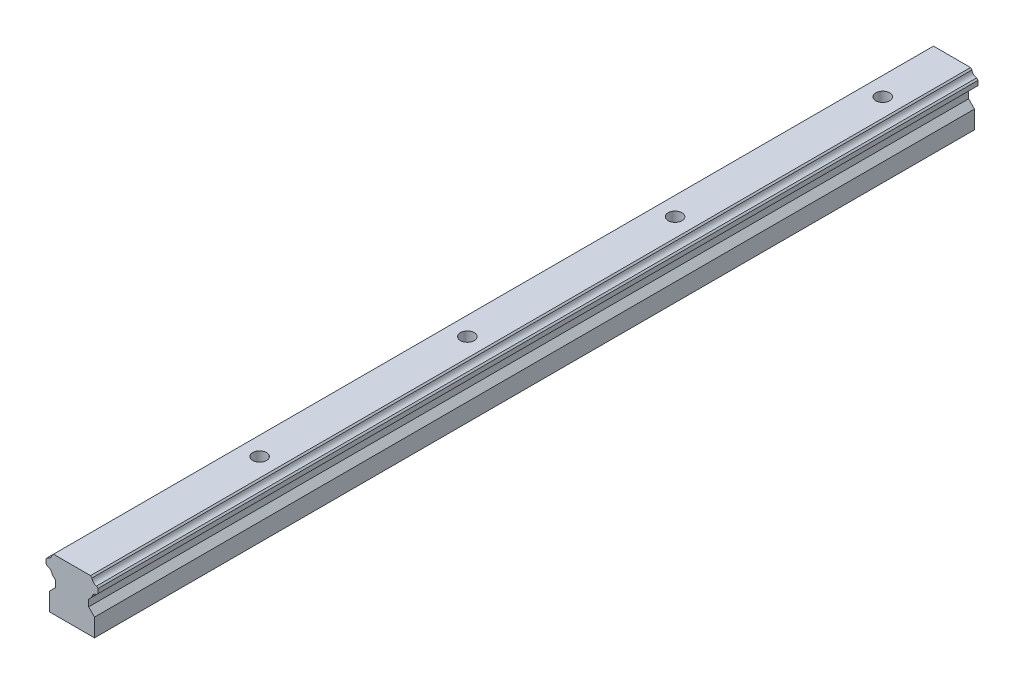
ISO-10303-21;
HEADER;
FILE_DESCRIPTION(('STEP AP214'),'2;1');
FILE_NAME('part.step','',(''),(''),'','','');
FILE_SCHEMA(('AUTOMOTIVE_DESIGN { 1 0 10303 214 1 1 1 1 }'));
ENDSEC;
DATA;
#1=APPLICATION_CONTEXT('core data for automotive mechanical design processes');
#2=APPLICATION_PROTOCOL_DEFINITION('international standard','automotive_design',2000,#1);
#3=PRODUCT_CONTEXT('',#1,'mechanical');
#4=PRODUCT('Part','Part','',(#3));
#5=PRODUCT_RELATED_PRODUCT_CATEGORY('part','',(#4));
#6=PRODUCT_DEFINITION_FORMATION('','',#4);
#7=PRODUCT_DEFINITION_CONTEXT('part definition',#1,'design');
#8=PRODUCT_DEFINITION('design','',#6,#7);
#9=PRODUCT_DEFINITION_SHAPE('','',#8);
#10=(LENGTH_UNIT() NAMED_UNIT(*) SI_UNIT(.MILLI.,.METRE.));
#11=(NAMED_UNIT(*) PLANE_ANGLE_UNIT() SI_UNIT($,.RADIAN.));
#12=(NAMED_UNIT(*) SI_UNIT($,.STERADIAN.) SOLID_ANGLE_UNIT());
#13=UNCERTAINTY_MEASURE_WITH_UNIT(LENGTH_MEASURE(1.E-05),#10,'distance_accuracy_value','');
#14=(GEOMETRIC_REPRESENTATION_CONTEXT(3) GLOBAL_UNCERTAINTY_ASSIGNED_CONTEXT((#13)) GLOBAL_UNIT_ASSIGNED_CONTEXT((#10,
#11,#12)) REPRESENTATION_CONTEXT('',''));
#15=CARTESIAN_POINT('',(0.,0.,0.));
#16=DIRECTION('',(0.,0.,1.));
#17=DIRECTION('',(1.,0.,0.));
#18=AXIS2_PLACEMENT_3D('',#15,#16,#17);
#19=CARTESIAN_POINT('',(-6.5,5.20000000000005,254.));
#20=DIRECTION('',(0.707106781186548,-0.707106781186548,0.));
#21=DIRECTION('',(0.707106781186548,0.707106781186548,0.));
#22=AXIS2_PLACEMENT_3D('',#19,#20,#21);
#23=PLANE('',#22);
#24=DIRECTION('',(-0.707106781186547,-0.707106781186547,0.));
#25=VECTOR('',#24,1.);
#26=CARTESIAN_POINT('',(-6.5,5.20000000000005,0.));
#27=LINE('',#26,#25);
#28=CARTESIAN_POINT('',(-4.8,6.90000000000005,0.));
#29=VERTEX_POINT('',#28);
#30=CARTESIAN_POINT('',(-6.5,5.20000000000005,0.));
#31=VERTEX_POINT('',#30);
#32=EDGE_CURVE('E214',#29,#31,#27,.T.);
#33=ORIENTED_EDGE('',*,*,#32,.T.);
#34=DIRECTION('',(0.,0.,-1.));
#35=VECTOR('',#34,1.);
#36=CARTESIAN_POINT('',(-6.5,5.20000000000005,254.));
#37=LINE('',#36,#35);
#38=CARTESIAN_POINT('',(-6.5,5.20000000000005,254.));
#39=VERTEX_POINT('',#38);
#40=EDGE_CURVE('E11',#39,#31,#37,.T.);
#41=ORIENTED_EDGE('',*,*,#40,.F.);
#42=DIRECTION('',(-0.707106781186547,-0.707106781186547,0.));
#43=VECTOR('',#42,1.);
#44=CARTESIAN_POINT('',(-6.5,5.20000000000005,254.));
#45=LINE('',#44,#43);
#46=CARTESIAN_POINT('',(-4.8,6.90000000000005,254.));
#47=VERTEX_POINT('',#46);
#48=EDGE_CURVE('E257',#47,#39,#45,.T.);
#49=ORIENTED_EDGE('',*,*,#48,.F.);
#50=DIRECTION('',(0.,0.,-1.));
#51=VECTOR('',#50,1.);
#52=CARTESIAN_POINT('',(-4.8,6.90000000000005,254.));
#53=LINE('',#52,#51);
#54=EDGE_CURVE('E210',#47,#29,#53,.T.);
#55=ORIENTED_EDGE('',*,*,#54,.T.);
#56=EDGE_LOOP('',(#33,#41,#49,#55));
#57=FACE_BOUND('',#56,.T.);
#58=ADVANCED_FACE('F34',(#57),#23,.F.);
#59=CARTESIAN_POINT('',(-6.5,5.20000000000005,254.));
#60=DIRECTION('',(1.,0.,0.));
#61=DIRECTION('',(0.,0.,-1.));
#62=AXIS2_PLACEMENT_3D('',#59,#60,#61);
#63=PLANE('',#62);
#64=DIRECTION('',(0.,-1.,0.));
#65=VECTOR('',#64,1.);
#66=CARTESIAN_POINT('',(-6.5,5.20000000000005,0.));
#67=LINE('',#66,#65);
#68=CARTESIAN_POINT('',(-6.5,0.,0.));
#69=VERTEX_POINT('',#68);
#70=EDGE_CURVE('E217',#31,#69,#67,.T.);
#71=ORIENTED_EDGE('',*,*,#70,.T.);
#72=DIRECTION('',(0.,0.,-1.));
#73=VECTOR('',#72,1.);
#74=CARTESIAN_POINT('',(-6.5,0.,254.));
#75=LINE('',#74,#73);
#76=CARTESIAN_POINT('',(-6.5,0.,254.));
#77=VERTEX_POINT('',#76);
#78=EDGE_CURVE('E42',#77,#69,#75,.T.);
#79=ORIENTED_EDGE('',*,*,#78,.F.);
#80=DIRECTION('',(0.,-1.,0.));
#81=VECTOR('',#80,1.);
#82=CARTESIAN_POINT('',(-6.5,5.20000000000005,254.));
#83=LINE('',#82,#81);
#84=EDGE_CURVE('E135',#39,#77,#83,.T.);
#85=ORIENTED_EDGE('',*,*,#84,.F.);
#86=ORIENTED_EDGE('',*,*,#40,.T.);
#87=EDGE_LOOP('',(#71,#79,#85,#86));
#88=FACE_BOUND('',#87,.T.);
#89=ADVANCED_FACE('F385',(#88),#63,.F.);
#90=CARTESIAN_POINT('',(-6.5,0.,254.));
#91=DIRECTION('',(0.,1.,0.));
#92=DIRECTION('',(0.,0.,1.));
#93=AXIS2_PLACEMENT_3D('',#90,#91,#92);
#94=PLANE('',#93);
#95=CARTESIAN_POINT('',(0.,0.,20.));
#96=DIRECTION('',(0.,1.,0.));
#97=DIRECTION('',(0.,0.,1.));
#98=AXIS2_PLACEMENT_3D('',#95,#96,#97);
#99=CIRCLE('',#98,2.);
#100=CARTESIAN_POINT('',(0.,0.,22.));
#101=VERTEX_POINT('',#100);
#102=EDGE_CURVE('E218',#101,#101,#99,.T.);
#103=ORIENTED_EDGE('',*,*,#102,.T.);
#104=EDGE_LOOP('',(#103));
#105=FACE_BOUND('',#104,.T.);
#106=CARTESIAN_POINT('',(0.,0.,79.944));
#107=DIRECTION('',(0.,1.,0.));
#108=DIRECTION('',(0.,0.,1.));
#109=AXIS2_PLACEMENT_3D('',#106,#107,#108);
#110=CIRCLE('',#109,2.);
#111=CARTESIAN_POINT('',(0.,0.,81.944));
#112=VERTEX_POINT('',#111);
#113=EDGE_CURVE('E543',#112,#112,#110,.T.);
#114=ORIENTED_EDGE('',*,*,#113,.T.);
#115=EDGE_LOOP('',(#114));
#116=FACE_BOUND('',#115,.T.);
#117=CARTESIAN_POINT('',(0.,0.,139.888));
#118=DIRECTION('',(0.,1.,0.));
#119=DIRECTION('',(0.,0.,1.));
#120=AXIS2_PLACEMENT_3D('',#117,#118,#119);
#121=CIRCLE('',#120,2.);
#122=CARTESIAN_POINT('',(0.,0.,141.888));
#123=VERTEX_POINT('',#122);
#124=EDGE_CURVE('E552',#123,#123,#121,.T.);
#125=ORIENTED_EDGE('',*,*,#124,.T.);
#126=EDGE_LOOP('',(#125));
#127=FACE_BOUND('',#126,.T.);
#128=CARTESIAN_POINT('',(0.,0.,199.832));
#129=DIRECTION('',(0.,1.,0.));
#130=DIRECTION('',(0.,0.,1.));
#131=AXIS2_PLACEMENT_3D('',#128,#129,#130);
#132=CIRCLE('',#131,2.);
#133=CARTESIAN_POINT('',(0.,0.,201.832));
#134=VERTEX_POINT('',#133);
#135=EDGE_CURVE('E558',#134,#134,#132,.T.);
#136=ORIENTED_EDGE('',*,*,#135,.T.);
#137=EDGE_LOOP('',(#136));
#138=FACE_BOUND('',#137,.T.);
#139=DIRECTION('',(1.,0.,0.));
#140=VECTOR('',#139,1.);
#141=CARTESIAN_POINT('',(-6.5,0.,0.));
#142=LINE('',#141,#140);
#143=CARTESIAN_POINT('',(6.5,0.,0.));
#144=VERTEX_POINT('',#143);
#145=EDGE_CURVE('E220',#69,#144,#142,.T.);
#146=ORIENTED_EDGE('',*,*,#145,.T.);
#147=DIRECTION('',(0.,0.,-1.));
#148=VECTOR('',#147,1.);
#149=CARTESIAN_POINT('',(6.5,0.,254.));
#150=LINE('',#149,#148);
#151=CARTESIAN_POINT('',(6.5,0.,254.));
#152=VERTEX_POINT('',#151);
#153=EDGE_CURVE('E306',#152,#144,#150,.T.);
#154=ORIENTED_EDGE('',*,*,#153,.F.);
#155=DIRECTION('',(1.,0.,0.));
#156=VECTOR('',#155,1.);
#157=CARTESIAN_POINT('',(-6.5,0.,254.));
#158=LINE('',#157,#156);
#159=EDGE_CURVE('E314',#77,#152,#158,.T.);
#160=ORIENTED_EDGE('',*,*,#159,.F.);
#161=ORIENTED_EDGE('',*,*,#78,.T.);
#162=EDGE_LOOP('',(#146,#154,#160,#161));
#163=FACE_BOUND('',#162,.T.);
#164=ADVANCED_FACE('F312',(#105,#116,#127,#138,#163),#94,.F.);
#165=CARTESIAN_POINT('',(6.5,5.20000000000005,254.));
#166=DIRECTION('',(-1.,0.,0.));
#167=DIRECTION('',(0.,0.,1.));
#168=AXIS2_PLACEMENT_3D('',#165,#166,#167);
#169=PLANE('',#168);
#170=DIRECTION('',(0.,1.,0.));
#171=VECTOR('',#170,1.);
#172=CARTESIAN_POINT('',(6.5,5.20000000000005,0.));
#173=LINE('',#172,#171);
#174=CARTESIAN_POINT('',(6.5,5.20000000000005,0.));
#175=VERTEX_POINT('',#174);
#176=EDGE_CURVE('E222',#144,#175,#173,.T.);
#177=ORIENTED_EDGE('',*,*,#176,.T.);
#178=DIRECTION('',(0.,0.,-1.));
#179=VECTOR('',#178,1.);
#180=CARTESIAN_POINT('',(6.5,5.20000000000005,254.));
#181=LINE('',#180,#179);
#182=CARTESIAN_POINT('',(6.5,5.20000000000005,254.));
#183=VERTEX_POINT('',#182);
#184=EDGE_CURVE('E303',#183,#175,#181,.T.);
#185=ORIENTED_EDGE('',*,*,#184,.F.);
#186=DIRECTION('',(0.,1.,0.));
#187=VECTOR('',#186,1.);
#188=CARTESIAN_POINT('',(6.5,5.20000000000005,254.));
#189=LINE('',#188,#187);
#190=EDGE_CURVE('E332',#152,#183,#189,.T.);
#191=ORIENTED_EDGE('',*,*,#190,.F.);
#192=ORIENTED_EDGE('',*,*,#153,.T.);
#193=EDGE_LOOP('',(#177,#185,#191,#192));
#194=FACE_BOUND('',#193,.T.);
#195=ADVANCED_FACE('F323',(#194),#169,.F.);
#196=CARTESIAN_POINT('',(4.8,6.90000000000005,254.));
#197=DIRECTION('',(-0.707106781186548,-0.707106781186548,0.));
#198=DIRECTION('',(0.707106781186548,-0.707106781186548,0.));
#199=AXIS2_PLACEMENT_3D('',#196,#197,#198);
#200=PLANE('',#199);
#201=DIRECTION('',(-0.707106781186547,0.707106781186547,0.));
#202=VECTOR('',#201,1.);
#203=CARTESIAN_POINT('',(4.8,6.90000000000005,0.));
#204=LINE('',#203,#202);
#205=CARTESIAN_POINT('',(4.8,6.90000000000005,0.));
#206=VERTEX_POINT('',#205);
#207=EDGE_CURVE('E224',#175,#206,#204,.T.);
#208=ORIENTED_EDGE('',*,*,#207,.T.);
#209=DIRECTION('',(0.,0.,-1.));
#210=VECTOR('',#209,1.);
#211=CARTESIAN_POINT('',(4.8,6.90000000000005,254.));
#212=LINE('',#211,#210);
#213=CARTESIAN_POINT('',(4.8,6.90000000000005,254.));
#214=VERTEX_POINT('',#213);
#215=EDGE_CURVE('E300',#214,#206,#212,.T.);
#216=ORIENTED_EDGE('',*,*,#215,.F.);
#217=DIRECTION('',(-0.707106781186547,0.707106781186547,0.));
#218=VECTOR('',#217,1.);
#219=CARTESIAN_POINT('',(4.8,6.90000000000005,254.));
#220=LINE('',#219,#218);
#221=EDGE_CURVE('E329',#183,#214,#220,.T.);
#222=ORIENTED_EDGE('',*,*,#221,.F.);
#223=ORIENTED_EDGE('',*,*,#184,.T.);
#224=EDGE_LOOP('',(#208,#216,#222,#223));
#225=FACE_BOUND('',#224,.T.);
#226=ADVANCED_FACE('F327',(#225),#200,.F.);
#227=CARTESIAN_POINT('',(4.8,8.84000000000005,254.));
#228=DIRECTION('',(-1.,0.,0.));
#229=DIRECTION('',(0.,0.,1.));
#230=AXIS2_PLACEMENT_3D('',#227,#228,#229);
#231=PLANE('',#230);
#232=DIRECTION('',(0.,1.,0.));
#233=VECTOR('',#232,1.);
#234=CARTESIAN_POINT('',(4.8,8.84000000000005,0.));
#235=LINE('',#234,#233);
#236=CARTESIAN_POINT('',(4.8,8.84000000000005,0.));
#237=VERTEX_POINT('',#236);
#238=EDGE_CURVE('E226',#206,#237,#235,.T.);
#239=ORIENTED_EDGE('',*,*,#238,.T.);
#240=DIRECTION('',(0.,0.,-1.));
#241=VECTOR('',#240,1.);
#242=CARTESIAN_POINT('',(4.8,8.84000000000005,254.));
#243=LINE('',#242,#241);
#244=CARTESIAN_POINT('',(4.8,8.84000000000005,254.));
#245=VERTEX_POINT('',#244);
#246=EDGE_CURVE('E297',#245,#237,#243,.T.);
#247=ORIENTED_EDGE('',*,*,#246,.F.);
#248=DIRECTION('',(0.,1.,0.));
#249=VECTOR('',#248,1.);
#250=CARTESIAN_POINT('',(4.8,8.84000000000005,254.));
#251=LINE('',#250,#249);
#252=EDGE_CURVE('E331',#214,#245,#251,.T.);
#253=ORIENTED_EDGE('',*,*,#252,.F.);
#254=ORIENTED_EDGE('',*,*,#215,.T.);
#255=EDGE_LOOP('',(#239,#247,#253,#254));
#256=FACE_BOUND('',#255,.T.);
#257=ADVANCED_FACE('F399',(#256),#231,.F.);
#258=CARTESIAN_POINT('',(5.7548684340674,9.79486843406745,254.));
#259=DIRECTION('',(-0.707106781186548,0.707106781186547,0.));
#260=DIRECTION('',(-0.707106781186547,-0.707106781186548,0.));
#261=AXIS2_PLACEMENT_3D('',#258,#259,#260);
#262=PLANE('',#261);
#263=DIRECTION('',(0.707106781186547,0.707106781186548,0.));
#264=VECTOR('',#263,1.);
#265=CARTESIAN_POINT('',(5.7548684340674,9.79486843406745,0.));
#266=LINE('',#265,#264);
#267=CARTESIAN_POINT('',(5.7548684340674,9.79486843406745,0.));
#268=VERTEX_POINT('',#267);
#269=EDGE_CURVE('E228',#237,#268,#266,.T.);
#270=ORIENTED_EDGE('',*,*,#269,.T.);
#271=DIRECTION('',(0.,0.,-1.));
#272=VECTOR('',#271,1.);
#273=CARTESIAN_POINT('',(5.7548684340674,9.79486843406745,254.));
#274=LINE('',#273,#272);
#275=CARTESIAN_POINT('',(5.7548684340674,9.79486843406745,254.));
#276=VERTEX_POINT('',#275);
#277=EDGE_CURVE('E294',#276,#268,#274,.T.);
#278=ORIENTED_EDGE('',*,*,#277,.F.);
#279=DIRECTION('',(0.707106781186547,0.707106781186548,0.));
#280=VECTOR('',#279,1.);
#281=CARTESIAN_POINT('',(5.7548684340674,9.79486843406745,254.));
#282=LINE('',#281,#280);
#283=EDGE_CURVE('E334',#245,#276,#282,.T.);
#284=ORIENTED_EDGE('',*,*,#283,.F.);
#285=ORIENTED_EDGE('',*,*,#246,.T.);
#286=EDGE_LOOP('',(#270,#278,#284,#285));
#287=FACE_BOUND('',#286,.T.);
#288=ADVANCED_FACE('F402',(#287),#262,.F.);
#289=CARTESIAN_POINT('',(7.29999999999997,9.58000000000008,254.));
#290=DIRECTION('',(0.,0.,-1.));
#291=DIRECTION('',(-1.,0.,0.));
#292=AXIS2_PLACEMENT_3D('',#289,#290,#291);
#293=CYLINDRICAL_SURFACE('',#292,1.55999999999993);
#294=CARTESIAN_POINT('',(7.29999999999997,9.58000000000008,0.));
#295=DIRECTION('',(0.,0.,-1.));
#296=DIRECTION('',(1.,0.,0.));
#297=AXIS2_PLACEMENT_3D('',#294,#295,#296);
#298=CIRCLE('',#297,1.55999999999993);
#299=CARTESIAN_POINT('',(7.0851315659326,11.1251315659326,0.));
#300=VERTEX_POINT('',#299);
#301=EDGE_CURVE('E230',#268,#300,#298,.T.);
#302=ORIENTED_EDGE('',*,*,#301,.T.);
#303=DIRECTION('',(0.,0.,-1.));
#304=VECTOR('',#303,1.);
#305=CARTESIAN_POINT('',(7.0851315659326,11.1251315659326,254.));
#306=LINE('',#305,#304);
#307=CARTESIAN_POINT('',(7.0851315659326,11.1251315659326,254.));
#308=VERTEX_POINT('',#307);
#309=EDGE_CURVE('E291',#308,#300,#306,.T.);
#310=ORIENTED_EDGE('',*,*,#309,.F.);
#311=CARTESIAN_POINT('',(7.29999999999997,9.58000000000008,254.));
#312=DIRECTION('',(0.,0.,-1.));
#313=DIRECTION('',(1.,0.,0.));
#314=AXIS2_PLACEMENT_3D('',#311,#312,#313);
#315=CIRCLE('',#314,1.55999999999993);
#316=EDGE_CURVE('E340',#276,#308,#315,.T.);
#317=ORIENTED_EDGE('',*,*,#316,.F.);
#318=ORIENTED_EDGE('',*,*,#277,.T.);
#319=EDGE_LOOP('',(#302,#310,#317,#318));
#320=FACE_BOUND('',#319,.T.);
#321=ADVANCED_FACE('F406',(#320),#293,.F.);
#322=CARTESIAN_POINT('',(7.5,11.54,254.));
#323=DIRECTION('',(-0.707106781186548,0.707106781186547,0.));
#324=DIRECTION('',(-0.707106781186547,-0.707106781186548,0.));
#325=AXIS2_PLACEMENT_3D('',#322,#323,#324);
#326=PLANE('',#325);
#327=DIRECTION('',(0.707106781186547,0.707106781186548,0.));
#328=VECTOR('',#327,1.);
#329=CARTESIAN_POINT('',(7.5,11.54,0.));
#330=LINE('',#329,#328);
#331=CARTESIAN_POINT('',(7.5,11.54,0.));
#332=VERTEX_POINT('',#331);
#333=EDGE_CURVE('E232',#300,#332,#330,.T.);
#334=ORIENTED_EDGE('',*,*,#333,.T.);
#335=DIRECTION('',(0.,0.,-1.));
#336=VECTOR('',#335,1.);
#337=CARTESIAN_POINT('',(7.5,11.54,254.));
#338=LINE('',#337,#336);
#339=CARTESIAN_POINT('',(7.5,11.54,254.));
#340=VERTEX_POINT('',#339);
#341=EDGE_CURVE('E288',#340,#332,#338,.T.);
#342=ORIENTED_EDGE('',*,*,#341,.F.);
#343=DIRECTION('',(0.707106781186547,0.707106781186548,0.));
#344=VECTOR('',#343,1.);
#345=CARTESIAN_POINT('',(7.5,11.54,254.));
#346=LINE('',#345,#344);
#347=EDGE_CURVE('E342',#308,#340,#346,.T.);
#348=ORIENTED_EDGE('',*,*,#347,.F.);
#349=ORIENTED_EDGE('',*,*,#309,.T.);
#350=EDGE_LOOP('',(#334,#342,#348,#349));
#351=FACE_BOUND('',#350,.T.);
#352=ADVANCED_FACE('F410',(#351),#326,.F.);
#353=CARTESIAN_POINT('',(7.5,12.85,254.));
#354=DIRECTION('',(-1.,0.,0.));
#355=DIRECTION('',(0.,0.,1.));
#356=AXIS2_PLACEMENT_3D('',#353,#354,#355);
#357=PLANE('',#356);
#358=DIRECTION('',(0.,1.,0.));
#359=VECTOR('',#358,1.);
#360=CARTESIAN_POINT('',(7.5,12.85,0.));
#361=LINE('',#360,#359);
#362=CARTESIAN_POINT('',(7.5,12.85,0.));
#363=VERTEX_POINT('',#362);
#364=EDGE_CURVE('E234',#332,#363,#361,.T.);
#365=ORIENTED_EDGE('',*,*,#364,.T.);
#366=DIRECTION('',(0.,0.,-1.));
#367=VECTOR('',#366,1.);
#368=CARTESIAN_POINT('',(7.5,12.85,254.));
#369=LINE('',#368,#367);
#370=CARTESIAN_POINT('',(7.5,12.85,254.));
#371=VERTEX_POINT('',#370);
#372=EDGE_CURVE('E285',#371,#363,#369,.T.);
#373=ORIENTED_EDGE('',*,*,#372,.F.);
#374=DIRECTION('',(0.,1.,0.));
#375=VECTOR('',#374,1.);
#376=CARTESIAN_POINT('',(7.5,12.85,254.));
#377=LINE('',#376,#375);
#378=EDGE_CURVE('E344',#340,#371,#377,.T.);
#379=ORIENTED_EDGE('',*,*,#378,.F.);
#380=ORIENTED_EDGE('',*,*,#341,.T.);
#381=EDGE_LOOP('',(#365,#373,#379,#380));
#382=FACE_BOUND('',#381,.T.);
#383=ADVANCED_FACE('F414',(#382),#357,.F.);
#384=CARTESIAN_POINT('',(7.0816423301223,13.2683576698777,254.));
#385=DIRECTION('',(-0.707106781186549,-0.707106781186546,0.));
#386=DIRECTION('',(0.707106781186546,-0.707106781186549,0.));
#387=AXIS2_PLACEMENT_3D('',#384,#385,#386);
#388=PLANE('',#387);
#389=DIRECTION('',(-0.707106781186546,0.707106781186549,0.));
#390=VECTOR('',#389,1.);
#391=CARTESIAN_POINT('',(7.0816423301223,13.2683576698777,0.));
#392=LINE('',#391,#390);
#393=CARTESIAN_POINT('',(7.0816423301223,13.2683576698777,0.));
#394=VERTEX_POINT('',#393);
#395=EDGE_CURVE('E236',#363,#394,#392,.T.);
#396=ORIENTED_EDGE('',*,*,#395,.T.);
#397=DIRECTION('',(0.,0.,-1.));
#398=VECTOR('',#397,1.);
#399=CARTESIAN_POINT('',(7.0816423301223,13.2683576698777,254.));
#400=LINE('',#399,#398);
#401=CARTESIAN_POINT('',(7.0816423301223,13.2683576698777,254.));
#402=VERTEX_POINT('',#401);
#403=EDGE_CURVE('E282',#402,#394,#400,.T.);
#404=ORIENTED_EDGE('',*,*,#403,.F.);
#405=DIRECTION('',(-0.707106781186546,0.707106781186549,0.));
#406=VECTOR('',#405,1.);
#407=CARTESIAN_POINT('',(7.0816423301223,13.2683576698777,254.));
#408=LINE('',#407,#406);
#409=EDGE_CURVE('E346',#371,#402,#408,.T.);
#410=ORIENTED_EDGE('',*,*,#409,.F.);
#411=ORIENTED_EDGE('',*,*,#372,.T.);
#412=EDGE_LOOP('',(#396,#404,#410,#411));
#413=FACE_BOUND('',#412,.T.);
#414=ADVANCED_FACE('F418',(#413),#388,.F.);
#415=CARTESIAN_POINT('',(7.30000000000014,14.8130000000002,254.));
#416=DIRECTION('',(0.,0.,-1.));
#417=DIRECTION('',(-1.,0.,0.));
#418=AXIS2_PLACEMENT_3D('',#415,#416,#417);
#419=CYLINDRICAL_SURFACE('',#418,1.56000000000018);
#420=CARTESIAN_POINT('',(7.30000000000014,14.8130000000002,0.));
#421=DIRECTION('',(0.,0.,-1.));
#422=DIRECTION('',(1.,0.,0.));
#423=AXIS2_PLACEMENT_3D('',#420,#421,#422);
#424=CIRCLE('',#423,1.56000000000018);
#425=CARTESIAN_POINT('',(5.7553576698777,14.5946423301223,0.));
#426=VERTEX_POINT('',#425);
#427=EDGE_CURVE('E238',#394,#426,#424,.T.);
#428=ORIENTED_EDGE('',*,*,#427,.T.);
#429=DIRECTION('',(0.,0.,-1.));
#430=VECTOR('',#429,1.);
#431=CARTESIAN_POINT('',(5.7553576698777,14.5946423301223,254.));
#432=LINE('',#431,#430);
#433=CARTESIAN_POINT('',(5.7553576698777,14.5946423301223,254.));
#434=VERTEX_POINT('',#433);
#435=EDGE_CURVE('E279',#434,#426,#432,.T.);
#436=ORIENTED_EDGE('',*,*,#435,.F.);
#437=CARTESIAN_POINT('',(7.30000000000014,14.8130000000002,254.));
#438=DIRECTION('',(0.,0.,-1.));
#439=DIRECTION('',(1.,0.,0.));
#440=AXIS2_PLACEMENT_3D('',#437,#438,#439);
#441=CIRCLE('',#440,1.56000000000018);
#442=EDGE_CURVE('E348',#402,#434,#441,.T.);
#443=ORIENTED_EDGE('',*,*,#442,.F.);
#444=ORIENTED_EDGE('',*,*,#403,.T.);
#445=EDGE_LOOP('',(#428,#436,#443,#444));
#446=FACE_BOUND('',#445,.T.);
#447=ADVANCED_FACE('F422',(#446),#419,.F.);
#448=CARTESIAN_POINT('',(5.35,15.,254.));
#449=DIRECTION('',(-0.707106781186549,-0.707106781186546,0.));
#450=DIRECTION('',(0.707106781186546,-0.707106781186549,0.));
#451=AXIS2_PLACEMENT_3D('',#448,#449,#450);
#452=PLANE('',#451);
#453=DIRECTION('',(-0.707106781186546,0.707106781186549,0.));
#454=VECTOR('',#453,1.);
#455=CARTESIAN_POINT('',(5.35,15.,0.));
#456=LINE('',#455,#454);
#457=CARTESIAN_POINT('',(5.35,15.,0.));
#458=VERTEX_POINT('',#457);
#459=EDGE_CURVE('E240',#426,#458,#456,.T.);
#460=ORIENTED_EDGE('',*,*,#459,.T.);
#461=DIRECTION('',(0.,0.,-1.));
#462=VECTOR('',#461,1.);
#463=CARTESIAN_POINT('',(5.35,15.,254.));
#464=LINE('',#463,#462);
#465=CARTESIAN_POINT('',(5.35,15.,254.));
#466=VERTEX_POINT('',#465);
#467=EDGE_CURVE('E276',#466,#458,#464,.T.);
#468=ORIENTED_EDGE('',*,*,#467,.F.);
#469=DIRECTION('',(-0.707106781186546,0.707106781186549,0.));
#470=VECTOR('',#469,1.);
#471=CARTESIAN_POINT('',(5.35,15.,254.));
#472=LINE('',#471,#470);
#473=EDGE_CURVE('E350',#434,#466,#472,.T.);
#474=ORIENTED_EDGE('',*,*,#473,.F.);
#475=ORIENTED_EDGE('',*,*,#435,.T.);
#476=EDGE_LOOP('',(#460,#468,#474,#475));
#477=FACE_BOUND('',#476,.T.);
#478=ADVANCED_FACE('F426',(#477),#452,.F.);
#479=CARTESIAN_POINT('',(-5.35,15.,254.));
#480=DIRECTION('',(0.,-1.,0.));
#481=DIRECTION('',(0.,0.,-1.));
#482=AXIS2_PLACEMENT_3D('',#479,#480,#481);
#483=PLANE('',#482);
#484=CARTESIAN_POINT('',(0.,15.,20.));
#485=DIRECTION('',(0.,1.,0.));
#486=DIRECTION('',(0.,0.,1.));
#487=AXIS2_PLACEMENT_3D('',#484,#485,#486);
#488=CIRCLE('',#487,2.);
#489=CARTESIAN_POINT('',(0.,15.,22.));
#490=VERTEX_POINT('',#489);
#491=EDGE_CURVE('E542',#490,#490,#488,.T.);
#492=ORIENTED_EDGE('',*,*,#491,.F.);
#493=EDGE_LOOP('',(#492));
#494=FACE_BOUND('',#493,.T.);
#495=CARTESIAN_POINT('',(0.,15.,79.944));
#496=DIRECTION('',(0.,1.,0.));
#497=DIRECTION('',(0.,0.,1.));
#498=AXIS2_PLACEMENT_3D('',#495,#496,#497);
#499=CIRCLE('',#498,2.);
#500=CARTESIAN_POINT('',(0.,15.,81.944));
#501=VERTEX_POINT('',#500);
#502=EDGE_CURVE('E547',#501,#501,#499,.T.);
#503=ORIENTED_EDGE('',*,*,#502,.F.);
#504=EDGE_LOOP('',(#503));
#505=FACE_BOUND('',#504,.T.);
#506=CARTESIAN_POINT('',(0.,15.,139.888));
#507=DIRECTION('',(0.,1.,0.));
#508=DIRECTION('',(0.,0.,1.));
#509=AXIS2_PLACEMENT_3D('',#506,#507,#508);
#510=CIRCLE('',#509,2.);
#511=CARTESIAN_POINT('',(0.,15.,141.888));
#512=VERTEX_POINT('',#511);
#513=EDGE_CURVE('E555',#512,#512,#510,.T.);
#514=ORIENTED_EDGE('',*,*,#513,.F.);
#515=EDGE_LOOP('',(#514));
#516=FACE_BOUND('',#515,.T.);
#517=CARTESIAN_POINT('',(0.,15.,199.832));
#518=DIRECTION('',(0.,1.,0.));
#519=DIRECTION('',(0.,0.,1.));
#520=AXIS2_PLACEMENT_3D('',#517,#518,#519);
#521=CIRCLE('',#520,2.);
#522=CARTESIAN_POINT('',(0.,15.,201.832));
#523=VERTEX_POINT('',#522);
#524=EDGE_CURVE('E561',#523,#523,#521,.T.);
#525=ORIENTED_EDGE('',*,*,#524,.F.);
#526=EDGE_LOOP('',(#525));
#527=FACE_BOUND('',#526,.T.);
#528=DIRECTION('',(-1.,0.,0.));
#529=VECTOR('',#528,1.);
#530=CARTESIAN_POINT('',(-5.35,15.,0.));
#531=LINE('',#530,#529);
#532=CARTESIAN_POINT('',(-5.35,15.,0.));
#533=VERTEX_POINT('',#532);
#534=EDGE_CURVE('E242',#458,#533,#531,.T.);
#535=ORIENTED_EDGE('',*,*,#534,.T.);
#536=DIRECTION('',(0.,0.,-1.));
#537=VECTOR('',#536,1.);
#538=CARTESIAN_POINT('',(-5.35,15.,254.));
#539=LINE('',#538,#537);
#540=CARTESIAN_POINT('',(-5.35,15.,254.));
#541=VERTEX_POINT('',#540);
#542=EDGE_CURVE('E273',#541,#533,#539,.T.);
#543=ORIENTED_EDGE('',*,*,#542,.F.);
#544=DIRECTION('',(-1.,0.,0.));
#545=VECTOR('',#544,1.);
#546=CARTESIAN_POINT('',(-5.35,15.,254.));
#547=LINE('',#546,#545);
#548=EDGE_CURVE('E352',#466,#541,#547,.T.);
#549=ORIENTED_EDGE('',*,*,#548,.F.);
#550=ORIENTED_EDGE('',*,*,#467,.T.);
#551=EDGE_LOOP('',(#535,#543,#549,#550));
#552=FACE_BOUND('',#551,.T.);
#553=ADVANCED_FACE('F430',(#494,#505,#516,#527,#552),#483,.F.);
#554=CARTESIAN_POINT('',(-5.7553576698777,14.5946423301223,254.));
#555=DIRECTION('',(0.707106781186548,-0.707106781186548,0.));
#556=DIRECTION('',(0.707106781186548,0.707106781186548,0.));
#557=AXIS2_PLACEMENT_3D('',#554,#555,#556);
#558=PLANE('',#557);
#559=DIRECTION('',(-0.707106781186547,-0.707106781186547,0.));
#560=VECTOR('',#559,1.);
#561=CARTESIAN_POINT('',(-5.7553576698777,14.5946423301223,0.));
#562=LINE('',#561,#560);
#563=CARTESIAN_POINT('',(-5.7553576698777,14.5946423301223,0.));
#564=VERTEX_POINT('',#563);
#565=EDGE_CURVE('E244',#533,#564,#562,.T.);
#566=ORIENTED_EDGE('',*,*,#565,.T.);
#567=DIRECTION('',(0.,0.,-1.));
#568=VECTOR('',#567,1.);
#569=CARTESIAN_POINT('',(-5.7553576698777,14.5946423301223,254.));
#570=LINE('',#569,#568);
#571=CARTESIAN_POINT('',(-5.7553576698777,14.5946423301223,254.));
#572=VERTEX_POINT('',#571);
#573=EDGE_CURVE('E270',#572,#564,#570,.T.);
#574=ORIENTED_EDGE('',*,*,#573,.F.);
#575=DIRECTION('',(-0.707106781186547,-0.707106781186547,0.));
#576=VECTOR('',#575,1.);
#577=CARTESIAN_POINT('',(-5.7553576698777,14.5946423301223,254.));
#578=LINE('',#577,#576);
#579=EDGE_CURVE('E354',#541,#572,#578,.T.);
#580=ORIENTED_EDGE('',*,*,#579,.F.);
#581=ORIENTED_EDGE('',*,*,#542,.T.);
#582=EDGE_LOOP('',(#566,#574,#580,#581));
#583=FACE_BOUND('',#582,.T.);
#584=ADVANCED_FACE('F434',(#583),#558,.F.);
#585=CARTESIAN_POINT('',(-7.30000000000015,14.8130000000002,254.));
#586=DIRECTION('',(0.,0.,-1.));
#587=DIRECTION('',(-1.,0.,0.));
#588=AXIS2_PLACEMENT_3D('',#585,#586,#587);
#589=CYLINDRICAL_SURFACE('',#588,1.56000000000019);
#590=CARTESIAN_POINT('',(-7.30000000000015,14.8130000000002,0.));
#591=DIRECTION('',(0.,0.,-1.));
#592=DIRECTION('',(1.,0.,0.));
#593=AXIS2_PLACEMENT_3D('',#590,#591,#592);
#594=CIRCLE('',#593,1.56000000000019);
#595=CARTESIAN_POINT('',(-7.0816423301223,13.2683576698777,0.));
#596=VERTEX_POINT('',#595);
#597=EDGE_CURVE('E246',#564,#596,#594,.T.);
#598=ORIENTED_EDGE('',*,*,#597,.T.);
#599=DIRECTION('',(0.,0.,-1.));
#600=VECTOR('',#599,1.);
#601=CARTESIAN_POINT('',(-7.0816423301223,13.2683576698777,254.));
#602=LINE('',#601,#600);
#603=CARTESIAN_POINT('',(-7.0816423301223,13.2683576698777,254.));
#604=VERTEX_POINT('',#603);
#605=EDGE_CURVE('E267',#604,#596,#602,.T.);
#606=ORIENTED_EDGE('',*,*,#605,.F.);
#607=CARTESIAN_POINT('',(-7.30000000000015,14.8130000000002,254.));
#608=DIRECTION('',(0.,0.,-1.));
#609=DIRECTION('',(1.,0.,0.));
#610=AXIS2_PLACEMENT_3D('',#607,#608,#609);
#611=CIRCLE('',#610,1.56000000000019);
#612=EDGE_CURVE('E356',#572,#604,#611,.T.);
#613=ORIENTED_EDGE('',*,*,#612,.F.);
#614=ORIENTED_EDGE('',*,*,#573,.T.);
#615=EDGE_LOOP('',(#598,#606,#613,#614));
#616=FACE_BOUND('',#615,.T.);
#617=ADVANCED_FACE('F438',(#616),#589,.F.);
#618=CARTESIAN_POINT('',(-7.5,12.85,254.));
#619=DIRECTION('',(0.707106781186549,-0.707106781186546,0.));
#620=DIRECTION('',(0.707106781186546,0.707106781186549,0.));
#621=AXIS2_PLACEMENT_3D('',#618,#619,#620);
#622=PLANE('',#621);
#623=DIRECTION('',(-0.707106781186546,-0.707106781186549,0.));
#624=VECTOR('',#623,1.);
#625=CARTESIAN_POINT('',(-7.5,12.85,0.));
#626=LINE('',#625,#624);
#627=CARTESIAN_POINT('',(-7.5,12.85,0.));
#628=VERTEX_POINT('',#627);
#629=EDGE_CURVE('E248',#596,#628,#626,.T.);
#630=ORIENTED_EDGE('',*,*,#629,.T.);
#631=DIRECTION('',(0.,0.,-1.));
#632=VECTOR('',#631,1.);
#633=CARTESIAN_POINT('',(-7.5,12.85,254.));
#634=LINE('',#633,#632);
#635=CARTESIAN_POINT('',(-7.5,12.85,254.));
#636=VERTEX_POINT('',#635);
#637=EDGE_CURVE('E264',#636,#628,#634,.T.);
#638=ORIENTED_EDGE('',*,*,#637,.F.);
#639=DIRECTION('',(-0.707106781186546,-0.707106781186549,0.));
#640=VECTOR('',#639,1.);
#641=CARTESIAN_POINT('',(-7.5,12.85,254.));
#642=LINE('',#641,#640);
#643=EDGE_CURVE('E358',#604,#636,#642,.T.);
#644=ORIENTED_EDGE('',*,*,#643,.F.);
#645=ORIENTED_EDGE('',*,*,#605,.T.);
#646=EDGE_LOOP('',(#630,#638,#644,#645));
#647=FACE_BOUND('',#646,.T.);
#648=ADVANCED_FACE('F442',(#647),#622,.F.);
#649=CARTESIAN_POINT('',(-7.5,11.54,254.));
#650=DIRECTION('',(1.,0.,0.));
#651=DIRECTION('',(0.,0.,-1.));
#652=AXIS2_PLACEMENT_3D('',#649,#650,#651);
#653=PLANE('',#652);
#654=DIRECTION('',(0.,-1.,0.));
#655=VECTOR('',#654,1.);
#656=CARTESIAN_POINT('',(-7.5,11.54,0.));
#657=LINE('',#656,#655);
#658=CARTESIAN_POINT('',(-7.5,11.54,0.));
#659=VERTEX_POINT('',#658);
#660=EDGE_CURVE('E250',#628,#659,#657,.T.);
#661=ORIENTED_EDGE('',*,*,#660,.T.);
#662=DIRECTION('',(0.,0.,-1.));
#663=VECTOR('',#662,1.);
#664=CARTESIAN_POINT('',(-7.5,11.54,254.));
#665=LINE('',#664,#663);
#666=CARTESIAN_POINT('',(-7.5,11.54,254.));
#667=VERTEX_POINT('',#666);
#668=EDGE_CURVE('E261',#667,#659,#665,.T.);
#669=ORIENTED_EDGE('',*,*,#668,.F.);
#670=DIRECTION('',(0.,-1.,0.));
#671=VECTOR('',#670,1.);
#672=CARTESIAN_POINT('',(-7.5,11.54,254.));
#673=LINE('',#672,#671);
#674=EDGE_CURVE('E360',#636,#667,#673,.T.);
#675=ORIENTED_EDGE('',*,*,#674,.F.);
#676=ORIENTED_EDGE('',*,*,#637,.T.);
#677=EDGE_LOOP('',(#661,#669,#675,#676));
#678=FACE_BOUND('',#677,.T.);
#679=ADVANCED_FACE('F366',(#678),#653,.F.);
#680=CARTESIAN_POINT('',(-7.0851315659326,11.1251315659326,254.));
#681=DIRECTION('',(0.707106781186548,0.707106781186547,0.));
#682=DIRECTION('',(-0.707106781186547,0.707106781186548,0.));
#683=AXIS2_PLACEMENT_3D('',#680,#681,#682);
#684=PLANE('',#683);
#685=DIRECTION('',(0.707106781186547,-0.707106781186548,0.));
#686=VECTOR('',#685,1.);
#687=CARTESIAN_POINT('',(-7.0851315659326,11.1251315659326,0.));
#688=LINE('',#687,#686);
#689=CARTESIAN_POINT('',(-7.0851315659326,11.1251315659326,0.));
#690=VERTEX_POINT('',#689);
#691=EDGE_CURVE('E252',#659,#690,#688,.T.);
#692=ORIENTED_EDGE('',*,*,#691,.T.);
#693=DIRECTION('',(0.,0.,-1.));
#694=VECTOR('',#693,1.);
#695=CARTESIAN_POINT('',(-7.0851315659326,11.1251315659326,254.));
#696=LINE('',#695,#694);
#697=CARTESIAN_POINT('',(-7.0851315659326,11.1251315659326,254.));
#698=VERTEX_POINT('',#697);
#699=EDGE_CURVE('E205',#698,#690,#696,.T.);
#700=ORIENTED_EDGE('',*,*,#699,.F.);
#701=DIRECTION('',(0.707106781186547,-0.707106781186548,0.));
#702=VECTOR('',#701,1.);
#703=CARTESIAN_POINT('',(-7.0851315659326,11.1251315659326,254.));
#704=LINE('',#703,#702);
#705=EDGE_CURVE('E196',#667,#698,#704,.T.);
#706=ORIENTED_EDGE('',*,*,#705,.F.);
#707=ORIENTED_EDGE('',*,*,#668,.T.);
#708=EDGE_LOOP('',(#692,#700,#706,#707));
#709=FACE_BOUND('',#708,.T.);
#710=ADVANCED_FACE('F370',(#709),#684,.F.);
#711=CARTESIAN_POINT('',(-7.29999999999997,9.58000000000008,254.));
#712=DIRECTION('',(0.,0.,-1.));
#713=DIRECTION('',(-1.,0.,0.));
#714=AXIS2_PLACEMENT_3D('',#711,#712,#713);
#715=CYLINDRICAL_SURFACE('',#714,1.55999999999994);
#716=CARTESIAN_POINT('',(-7.29999999999997,9.58000000000008,0.));
#717=DIRECTION('',(0.,0.,-1.));
#718=DIRECTION('',(1.,0.,0.));
#719=AXIS2_PLACEMENT_3D('',#716,#717,#718);
#720=CIRCLE('',#719,1.55999999999994);
#721=CARTESIAN_POINT('',(-5.7548684340674,9.79486843406745,0.));
#722=VERTEX_POINT('',#721);
#723=EDGE_CURVE('E204',#690,#722,#720,.T.);
#724=ORIENTED_EDGE('',*,*,#723,.T.);
#725=DIRECTION('',(0.,0.,-1.));
#726=VECTOR('',#725,1.);
#727=CARTESIAN_POINT('',(-5.7548684340674,9.79486843406745,254.));
#728=LINE('',#727,#726);
#729=CARTESIAN_POINT('',(-5.7548684340674,9.79486843406745,254.));
#730=VERTEX_POINT('',#729);
#731=EDGE_CURVE('E201',#730,#722,#728,.T.);
#732=ORIENTED_EDGE('',*,*,#731,.F.);
#733=CARTESIAN_POINT('',(-7.29999999999997,9.58000000000008,254.));
#734=DIRECTION('',(0.,0.,-1.));
#735=DIRECTION('',(1.,0.,0.));
#736=AXIS2_PLACEMENT_3D('',#733,#734,#735);
#737=CIRCLE('',#736,1.55999999999994);
#738=EDGE_CURVE('E190',#698,#730,#737,.T.);
#739=ORIENTED_EDGE('',*,*,#738,.F.);
#740=ORIENTED_EDGE('',*,*,#699,.T.);
#741=EDGE_LOOP('',(#724,#732,#739,#740));
#742=FACE_BOUND('',#741,.T.);
#743=ADVANCED_FACE('F202',(#742),#715,.F.);
#744=CARTESIAN_POINT('',(-4.8,8.84000000000005,254.));
#745=DIRECTION('',(0.707106781186548,0.707106781186547,0.));
#746=DIRECTION('',(-0.707106781186547,0.707106781186548,0.));
#747=AXIS2_PLACEMENT_3D('',#744,#745,#746);
#748=PLANE('',#747);
#749=DIRECTION('',(0.707106781186547,-0.707106781186548,0.));
#750=VECTOR('',#749,1.);
#751=CARTESIAN_POINT('',(-4.8,8.84000000000005,0.));
#752=LINE('',#751,#750);
#753=CARTESIAN_POINT('',(-4.8,8.84000000000005,0.));
#754=VERTEX_POINT('',#753);
#755=EDGE_CURVE('E121',#722,#754,#752,.T.);
#756=ORIENTED_EDGE('',*,*,#755,.T.);
#757=DIRECTION('',(0.,0.,-1.));
#758=VECTOR('',#757,1.);
#759=CARTESIAN_POINT('',(-4.8,8.84000000000005,254.));
#760=LINE('',#759,#758);
#761=CARTESIAN_POINT('',(-4.8,8.84000000000005,254.));
#762=VERTEX_POINT('',#761);
#763=EDGE_CURVE('E206',#762,#754,#760,.T.);
#764=ORIENTED_EDGE('',*,*,#763,.F.);
#765=DIRECTION('',(0.707106781186547,-0.707106781186548,0.));
#766=VECTOR('',#765,1.);
#767=CARTESIAN_POINT('',(-4.8,8.84000000000005,254.));
#768=LINE('',#767,#766);
#769=EDGE_CURVE('E194',#730,#762,#768,.T.);
#770=ORIENTED_EDGE('',*,*,#769,.F.);
#771=ORIENTED_EDGE('',*,*,#731,.T.);
#772=EDGE_LOOP('',(#756,#764,#770,#771));
#773=FACE_BOUND('',#772,.T.);
#774=ADVANCED_FACE('F208',(#773),#748,.F.);
#775=CARTESIAN_POINT('',(-4.8,6.90000000000005,254.));
#776=DIRECTION('',(1.,0.,0.));
#777=DIRECTION('',(0.,0.,-1.));
#778=AXIS2_PLACEMENT_3D('',#775,#776,#777);
#779=PLANE('',#778);
#780=DIRECTION('',(0.,-1.,0.));
#781=VECTOR('',#780,1.);
#782=CARTESIAN_POINT('',(-4.8,6.90000000000005,0.));
#783=LINE('',#782,#781);
#784=EDGE_CURVE('E127',#754,#29,#783,.T.);
#785=ORIENTED_EDGE('',*,*,#784,.T.);
#786=ORIENTED_EDGE('',*,*,#54,.F.);
#787=DIRECTION('',(0.,-1.,0.));
#788=VECTOR('',#787,1.);
#789=CARTESIAN_POINT('',(-4.8,6.90000000000005,254.));
#790=LINE('',#789,#788);
#791=EDGE_CURVE('E50',#762,#47,#790,.T.);
#792=ORIENTED_EDGE('',*,*,#791,.F.);
#793=ORIENTED_EDGE('',*,*,#763,.T.);
#794=EDGE_LOOP('',(#785,#786,#792,#793));
#795=FACE_BOUND('',#794,.T.);
#796=ADVANCED_FACE('F374',(#795),#779,.F.);
#797=CARTESIAN_POINT('',(-7.29999999999997,9.58000000000008,254.));
#798=DIRECTION('',(0.,0.,1.));
#799=DIRECTION('',(1.,0.,0.));
#800=AXIS2_PLACEMENT_3D('',#797,#798,#799);
#801=PLANE('',#800);
#802=ORIENTED_EDGE('',*,*,#48,.T.);
#803=ORIENTED_EDGE('',*,*,#84,.T.);
#804=ORIENTED_EDGE('',*,*,#159,.T.);
#805=ORIENTED_EDGE('',*,*,#190,.T.);
#806=ORIENTED_EDGE('',*,*,#221,.T.);
#807=ORIENTED_EDGE('',*,*,#252,.T.);
#808=ORIENTED_EDGE('',*,*,#283,.T.);
#809=ORIENTED_EDGE('',*,*,#316,.T.);
#810=ORIENTED_EDGE('',*,*,#347,.T.);
#811=ORIENTED_EDGE('',*,*,#378,.T.);
#812=ORIENTED_EDGE('',*,*,#409,.T.);
#813=ORIENTED_EDGE('',*,*,#442,.T.);
#814=ORIENTED_EDGE('',*,*,#473,.T.);
#815=ORIENTED_EDGE('',*,*,#548,.T.);
#816=ORIENTED_EDGE('',*,*,#579,.T.);
#817=ORIENTED_EDGE('',*,*,#612,.T.);
#818=ORIENTED_EDGE('',*,*,#643,.T.);
#819=ORIENTED_EDGE('',*,*,#674,.T.);
#820=ORIENTED_EDGE('',*,*,#705,.T.);
#821=ORIENTED_EDGE('',*,*,#738,.T.);
#822=ORIENTED_EDGE('',*,*,#769,.T.);
#823=ORIENTED_EDGE('',*,*,#791,.T.);
#824=EDGE_LOOP('',(#802,#803,#804,#805,#806,#807,#808,#809,#810,#811,#812,#813,#814,#815,#816,
#817,#818,#819,#820,#821,#822,#823));
#825=FACE_BOUND('',#824,.T.);
#826=ADVANCED_FACE('F192',(#825),#801,.T.);
#827=CARTESIAN_POINT('',(-7.29999999999997,9.58000000000008,0.));
#828=DIRECTION('',(0.,0.,1.));
#829=DIRECTION('',(1.,0.,0.));
#830=AXIS2_PLACEMENT_3D('',#827,#828,#829);
#831=PLANE('',#830);
#832=ORIENTED_EDGE('',*,*,#32,.F.);
#833=ORIENTED_EDGE('',*,*,#784,.F.);
#834=ORIENTED_EDGE('',*,*,#755,.F.);
#835=ORIENTED_EDGE('',*,*,#723,.F.);
#836=ORIENTED_EDGE('',*,*,#691,.F.);
#837=ORIENTED_EDGE('',*,*,#660,.F.);
#838=ORIENTED_EDGE('',*,*,#629,.F.);
#839=ORIENTED_EDGE('',*,*,#597,.F.);
#840=ORIENTED_EDGE('',*,*,#565,.F.);
#841=ORIENTED_EDGE('',*,*,#534,.F.);
#842=ORIENTED_EDGE('',*,*,#459,.F.);
#843=ORIENTED_EDGE('',*,*,#427,.F.);
#844=ORIENTED_EDGE('',*,*,#395,.F.);
#845=ORIENTED_EDGE('',*,*,#364,.F.);
#846=ORIENTED_EDGE('',*,*,#333,.F.);
#847=ORIENTED_EDGE('',*,*,#301,.F.);
#848=ORIENTED_EDGE('',*,*,#269,.F.);
#849=ORIENTED_EDGE('',*,*,#238,.F.);
#850=ORIENTED_EDGE('',*,*,#207,.F.);
#851=ORIENTED_EDGE('',*,*,#176,.F.);
#852=ORIENTED_EDGE('',*,*,#145,.F.);
#853=ORIENTED_EDGE('',*,*,#70,.F.);
#854=EDGE_LOOP('',(#832,#833,#834,#835,#836,#837,#838,#839,#840,#841,#842,#843,#844,#845,#846,
#847,#848,#849,#850,#851,#852,#853));
#855=FACE_BOUND('',#854,.T.);
#856=ADVANCED_FACE('F318',(#855),#831,.F.);
#857=CARTESIAN_POINT('',(0.,0.,199.832));
#858=DIRECTION('',(0.,1.,0.));
#859=DIRECTION('',(0.,0.,1.));
#860=AXIS2_PLACEMENT_3D('',#857,#858,#859);
#861=CYLINDRICAL_SURFACE('',#860,2.);
#862=ORIENTED_EDGE('',*,*,#135,.F.);
#863=EDGE_LOOP('',(#862));
#864=FACE_BOUND('',#863,.T.);
#865=ORIENTED_EDGE('',*,*,#524,.T.);
#866=EDGE_LOOP('',(#865));
#867=FACE_BOUND('',#866,.T.);
#868=ADVANCED_FACE('F479',(#864,#867),#861,.F.);
#869=CARTESIAN_POINT('',(0.,0.,139.888));
#870=DIRECTION('',(0.,1.,0.));
#871=DIRECTION('',(0.,0.,1.));
#872=AXIS2_PLACEMENT_3D('',#869,#870,#871);
#873=CYLINDRICAL_SURFACE('',#872,2.);
#874=ORIENTED_EDGE('',*,*,#124,.F.);
#875=EDGE_LOOP('',(#874));
#876=FACE_BOUND('',#875,.T.);
#877=ORIENTED_EDGE('',*,*,#513,.T.);
#878=EDGE_LOOP('',(#877));
#879=FACE_BOUND('',#878,.T.);
#880=ADVANCED_FACE('F503',(#876,#879),#873,.F.);
#881=CARTESIAN_POINT('',(0.,0.,79.944));
#882=DIRECTION('',(0.,1.,0.));
#883=DIRECTION('',(0.,0.,1.));
#884=AXIS2_PLACEMENT_3D('',#881,#882,#883);
#885=CYLINDRICAL_SURFACE('',#884,2.);
#886=ORIENTED_EDGE('',*,*,#113,.F.);
#887=EDGE_LOOP('',(#886));
#888=FACE_BOUND('',#887,.T.);
#889=ORIENTED_EDGE('',*,*,#502,.T.);
#890=EDGE_LOOP('',(#889));
#891=FACE_BOUND('',#890,.T.);
#892=ADVANCED_FACE('F513',(#888,#891),#885,.F.);
#893=CARTESIAN_POINT('',(0.,0.,20.));
#894=DIRECTION('',(0.,1.,0.));
#895=DIRECTION('',(0.,0.,1.));
#896=AXIS2_PLACEMENT_3D('',#893,#894,#895);
#897=CYLINDRICAL_SURFACE('',#896,2.);
#898=ORIENTED_EDGE('',*,*,#102,.F.);
#899=EDGE_LOOP('',(#898));
#900=FACE_BOUND('',#899,.T.);
#901=ORIENTED_EDGE('',*,*,#491,.T.);
#902=EDGE_LOOP('',(#901));
#903=FACE_BOUND('',#902,.T.);
#904=ADVANCED_FACE('F523',(#900,#903),#897,.F.);
#905=CLOSED_SHELL('',(#58,#89,#164,#195,#226,#257,#288,#321,#352,#383,#414,#447,#478,#553,#584,
#617,#648,#679,#710,#743,#774,#796,#826,#856,#868,#880,#892,#904));
#906=MANIFOLD_SOLID_BREP('B2',#905);
#907=ADVANCED_BREP_SHAPE_REPRESENTATION('',(#18,#906),#14);
#908=SHAPE_DEFINITION_REPRESENTATION(#9,#907);
ENDSEC;
END-ISO-10303-21;
